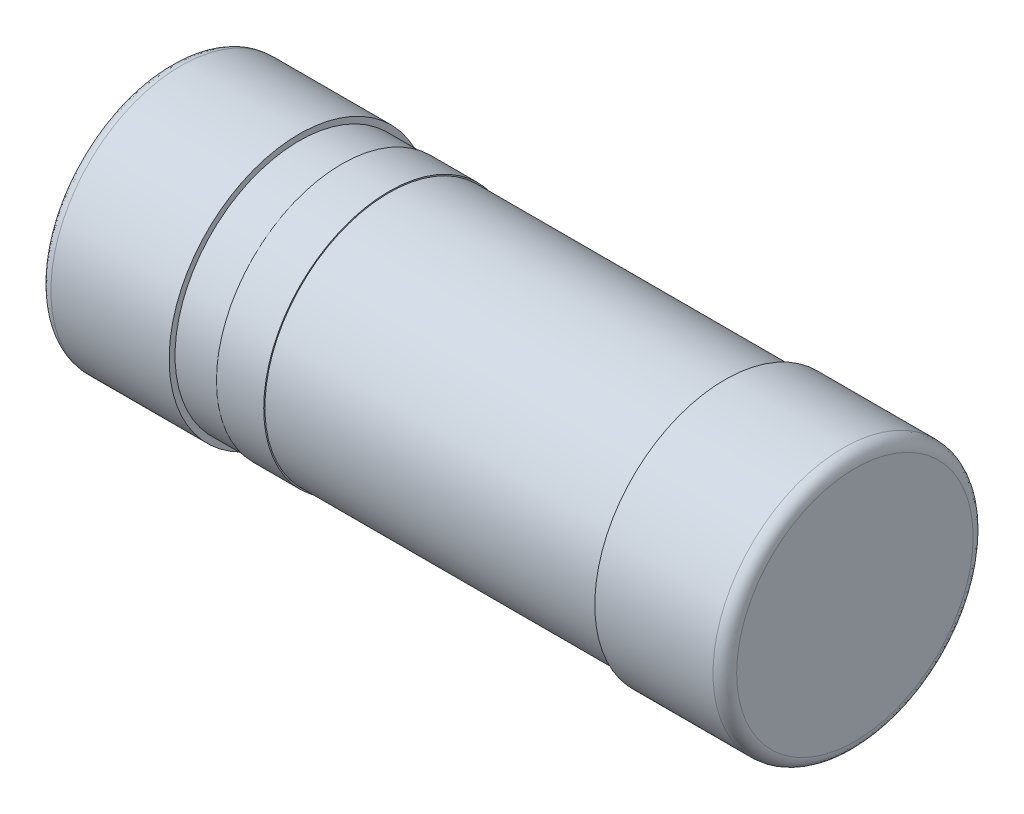
ISO-10303-21;
HEADER;
FILE_DESCRIPTION(('STEP AP214'),'2;1');
FILE_NAME('part.step','',(''),(''),'','','');
FILE_SCHEMA(('AUTOMOTIVE_DESIGN { 1 0 10303 214 1 1 1 1 }'));
ENDSEC;
DATA;
#1=APPLICATION_CONTEXT('core data for automotive mechanical design processes');
#2=APPLICATION_PROTOCOL_DEFINITION('international standard','automotive_design',2000,#1);
#3=PRODUCT_CONTEXT('',#1,'mechanical');
#4=PRODUCT('Part','Part','',(#3));
#5=PRODUCT_RELATED_PRODUCT_CATEGORY('part','',(#4));
#6=PRODUCT_DEFINITION_FORMATION('','',#4);
#7=PRODUCT_DEFINITION_CONTEXT('part definition',#1,'design');
#8=PRODUCT_DEFINITION('design','',#6,#7);
#9=PRODUCT_DEFINITION_SHAPE('','',#8);
#10=(LENGTH_UNIT() NAMED_UNIT(*) SI_UNIT(.MILLI.,.METRE.));
#11=(NAMED_UNIT(*) PLANE_ANGLE_UNIT() SI_UNIT($,.RADIAN.));
#12=(NAMED_UNIT(*) SI_UNIT($,.STERADIAN.) SOLID_ANGLE_UNIT());
#13=UNCERTAINTY_MEASURE_WITH_UNIT(LENGTH_MEASURE(1.E-05),#10,'distance_accuracy_value','');
#14=(GEOMETRIC_REPRESENTATION_CONTEXT(3) GLOBAL_UNCERTAINTY_ASSIGNED_CONTEXT((#13)) GLOBAL_UNIT_ASSIGNED_CONTEXT((#10,
#11,#12)) REPRESENTATION_CONTEXT('',''));
#15=CARTESIAN_POINT('',(0.,0.,0.));
#16=DIRECTION('',(0.,0.,1.));
#17=DIRECTION('',(1.,0.,0.));
#18=AXIS2_PLACEMENT_3D('',#15,#16,#17);
#19=CARTESIAN_POINT('',(-2.9,0.,1.1));
#20=DIRECTION('',(-1.,0.,0.));
#21=DIRECTION('',(0.,0.,1.));
#22=AXIS2_PLACEMENT_3D('',#19,#20,#21);
#23=PLANE('',#22);
#24=CARTESIAN_POINT('',(-2.9,0.,1.1));
#25=DIRECTION('',(-1.,0.,0.));
#26=DIRECTION('',(0.,0.,-1.));
#27=AXIS2_PLACEMENT_3D('',#24,#25,#26);
#28=CIRCLE('',#27,1.);
#29=CARTESIAN_POINT('',(-2.9,0.,0.09999999999999));
#30=VERTEX_POINT('',#29);
#31=EDGE_CURVE('E11',#30,#30,#28,.T.);
#32=ORIENTED_EDGE('',*,*,#31,.T.);
#33=EDGE_LOOP('',(#32));
#34=FACE_BOUND('',#33,.T.);
#35=ADVANCED_FACE('F17',(#34),#23,.T.);
#36=CARTESIAN_POINT('',(2.9,0.,1.1));
#37=DIRECTION('',(-1.,0.,0.));
#38=DIRECTION('',(0.,0.,1.));
#39=AXIS2_PLACEMENT_3D('',#36,#37,#38);
#40=PLANE('',#39);
#41=CARTESIAN_POINT('',(2.9,0.,1.1));
#42=DIRECTION('',(-1.,0.,0.));
#43=DIRECTION('',(0.,0.,-1.));
#44=AXIS2_PLACEMENT_3D('',#41,#42,#43);
#45=CIRCLE('',#44,1.);
#46=CARTESIAN_POINT('',(2.9,0.,0.1));
#47=VERTEX_POINT('',#46);
#48=EDGE_CURVE('E116',#47,#47,#45,.T.);
#49=ORIENTED_EDGE('',*,*,#48,.F.);
#50=EDGE_LOOP('',(#49));
#51=FACE_BOUND('',#50,.T.);
#52=ADVANCED_FACE('F157',(#51),#40,.F.);
#53=CARTESIAN_POINT('',(-2.9,0.,0.09999999999999));
#54=CARTESIAN_POINT('',(-2.89999999999999,0.,0.0414213562373039));
#55=CARTESIAN_POINT('',(-2.85857864376268,0.,0.));
#56=CARTESIAN_POINT('',(-2.8,0.,0.));
#57=(BOUNDED_CURVE() B_SPLINE_CURVE(3,(#53,#54,#55,#56),.UNSPECIFIED.,.F.,
.F.) B_SPLINE_CURVE_WITH_KNOTS((4,4),(0.,1.),
.UNSPECIFIED.) CURVE() GEOMETRIC_REPRESENTATION_ITEM() RATIONAL_B_SPLINE_CURVE((1.,
0.804737854124388,0.804737854124388,1.)) REPRESENTATION_ITEM(''));
#58=CARTESIAN_POINT('',(-7.1,0.,1.1));
#59=DIRECTION('',(1.,0.,0.));
#60=AXIS1_PLACEMENT('',#58,#59);
#61=SURFACE_OF_REVOLUTION('',#57,#60);
#62=CARTESIAN_POINT('',(-2.8,0.,0.1));
#63=DIRECTION('',(0.,-1.,0.));
#64=DIRECTION('',(1.,0.,0.));
#65=AXIS2_PLACEMENT_3D('',#62,#63,#64);
#66=CIRCLE('',#65,0.1);
#67=CARTESIAN_POINT('',(-2.8,0.,0.));
#68=VERTEX_POINT('',#67);
#69=EDGE_CURVE('E30',#30,#68,#66,.T.);
#70=ORIENTED_EDGE('',*,*,#69,.T.);
#71=CARTESIAN_POINT('',(-2.8,0.,1.1));
#72=DIRECTION('',(-1.,0.,0.));
#73=DIRECTION('',(0.,0.,-1.));
#74=AXIS2_PLACEMENT_3D('',#71,#72,#73);
#75=CIRCLE('',#74,1.1);
#76=EDGE_CURVE('E114',#68,#68,#75,.T.);
#77=ORIENTED_EDGE('',*,*,#76,.T.);
#78=ORIENTED_EDGE('',*,*,#69,.F.);
#79=ORIENTED_EDGE('',*,*,#31,.F.);
#80=EDGE_LOOP('',(#70,#77,#78,#79));
#81=FACE_BOUND('',#80,.T.);
#82=ADVANCED_FACE('F113',(#81),#61,.T.);
#83=CARTESIAN_POINT('',(2.8,0.,0.));
#84=CARTESIAN_POINT('',(2.85857864376269,0.,0.));
#85=CARTESIAN_POINT('',(2.9,0.,0.0414213562373093));
#86=CARTESIAN_POINT('',(2.9,0.,0.1));
#87=(BOUNDED_CURVE() B_SPLINE_CURVE(3,(#83,#84,#85,#86),.UNSPECIFIED.,.F.,
.F.) B_SPLINE_CURVE_WITH_KNOTS((4,4),(0.,1.),
.UNSPECIFIED.) CURVE() GEOMETRIC_REPRESENTATION_ITEM() RATIONAL_B_SPLINE_CURVE((1.,
0.804737854124364,0.804737854124364,1.)) REPRESENTATION_ITEM(''));
#88=CARTESIAN_POINT('',(-7.1,0.,1.1));
#89=DIRECTION('',(1.,0.,0.));
#90=AXIS1_PLACEMENT('',#88,#89);
#91=SURFACE_OF_REVOLUTION('',#87,#90);
#92=CARTESIAN_POINT('',(2.8,0.,0.1));
#93=DIRECTION('',(0.,-1.,0.));
#94=DIRECTION('',(1.,0.,0.));
#95=AXIS2_PLACEMENT_3D('',#92,#93,#94);
#96=CIRCLE('',#95,0.1);
#97=CARTESIAN_POINT('',(2.8,0.,0.));
#98=VERTEX_POINT('',#97);
#99=EDGE_CURVE('E105',#98,#47,#96,.T.);
#100=ORIENTED_EDGE('',*,*,#99,.T.);
#101=ORIENTED_EDGE('',*,*,#48,.T.);
#102=ORIENTED_EDGE('',*,*,#99,.F.);
#103=CARTESIAN_POINT('',(2.8,0.,1.1));
#104=DIRECTION('',(-1.,0.,0.));
#105=DIRECTION('',(0.,0.,-1.));
#106=AXIS2_PLACEMENT_3D('',#103,#104,#105);
#107=CIRCLE('',#106,1.1);
#108=EDGE_CURVE('E133',#98,#98,#107,.T.);
#109=ORIENTED_EDGE('',*,*,#108,.F.);
#110=EDGE_LOOP('',(#100,#101,#102,#109));
#111=FACE_BOUND('',#110,.T.);
#112=ADVANCED_FACE('F19',(#111),#91,.T.);
#113=CARTESIAN_POINT('',(-2.8,0.,1.1));
#114=DIRECTION('',(1.,0.,0.));
#115=DIRECTION('',(0.,0.,-1.));
#116=AXIS2_PLACEMENT_3D('',#113,#114,#115);
#117=CYLINDRICAL_SURFACE('',#116,1.1);
#118=DIRECTION('',(1.,0.,0.));
#119=VECTOR('',#118,1.);
#120=CARTESIAN_POINT('',(-2.8,0.,0.));
#121=LINE('',#120,#119);
#122=CARTESIAN_POINT('',(-1.8,0.,0.));
#123=VERTEX_POINT('',#122);
#124=EDGE_CURVE('E99',#68,#123,#121,.T.);
#125=ORIENTED_EDGE('',*,*,#124,.T.);
#126=CARTESIAN_POINT('',(-1.8,0.,1.1));
#127=DIRECTION('',(-1.,0.,0.));
#128=DIRECTION('',(0.,0.,-1.));
#129=AXIS2_PLACEMENT_3D('',#126,#127,#128);
#130=CIRCLE('',#129,1.1);
#131=EDGE_CURVE('E134',#123,#123,#130,.T.);
#132=ORIENTED_EDGE('',*,*,#131,.T.);
#133=ORIENTED_EDGE('',*,*,#124,.F.);
#134=ORIENTED_EDGE('',*,*,#76,.F.);
#135=EDGE_LOOP('',(#125,#132,#133,#134));
#136=FACE_BOUND('',#135,.T.);
#137=ADVANCED_FACE('F184',(#136),#117,.T.);
#138=CARTESIAN_POINT('',(1.8,0.,1.1));
#139=DIRECTION('',(1.,0.,0.));
#140=DIRECTION('',(0.,0.,-1.));
#141=AXIS2_PLACEMENT_3D('',#138,#139,#140);
#142=CYLINDRICAL_SURFACE('',#141,1.1);
#143=DIRECTION('',(1.,0.,0.));
#144=VECTOR('',#143,1.);
#145=CARTESIAN_POINT('',(1.8,0.,0.));
#146=LINE('',#145,#144);
#147=CARTESIAN_POINT('',(1.8,0.,0.));
#148=VERTEX_POINT('',#147);
#149=EDGE_CURVE('E90',#148,#98,#146,.T.);
#150=ORIENTED_EDGE('',*,*,#149,.T.);
#151=ORIENTED_EDGE('',*,*,#108,.T.);
#152=ORIENTED_EDGE('',*,*,#149,.F.);
#153=CARTESIAN_POINT('',(1.8,0.,1.1));
#154=DIRECTION('',(-1.,0.,0.));
#155=DIRECTION('',(0.,0.,-1.));
#156=AXIS2_PLACEMENT_3D('',#153,#154,#155);
#157=CIRCLE('',#156,1.1);
#158=EDGE_CURVE('E137',#148,#148,#157,.T.);
#159=ORIENTED_EDGE('',*,*,#158,.F.);
#160=EDGE_LOOP('',(#150,#151,#152,#159));
#161=FACE_BOUND('',#160,.T.);
#162=ADVANCED_FACE('F175',(#161),#142,.T.);
#163=CARTESIAN_POINT('',(-1.8,0.,1.1));
#164=DIRECTION('',(-1.,0.,0.));
#165=DIRECTION('',(0.,0.,1.));
#166=AXIS2_PLACEMENT_3D('',#163,#164,#165);
#167=PLANE('',#166);
#168=CARTESIAN_POINT('',(-1.8,0.,1.1));
#169=DIRECTION('',(-1.,0.,0.));
#170=DIRECTION('',(0.,0.,-1.));
#171=AXIS2_PLACEMENT_3D('',#168,#169,#170);
#172=CIRCLE('',#171,1.05);
#173=CARTESIAN_POINT('',(-1.8,0.,0.05));
#174=VERTEX_POINT('',#173);
#175=EDGE_CURVE('E125',#174,#174,#172,.T.);
#176=ORIENTED_EDGE('',*,*,#175,.T.);
#177=EDGE_LOOP('',(#176));
#178=FACE_BOUND('',#177,.T.);
#179=ORIENTED_EDGE('',*,*,#131,.F.);
#180=EDGE_LOOP('',(#179));
#181=FACE_BOUND('',#180,.T.);
#182=ADVANCED_FACE('F172',(#178,#181),#167,.F.);
#183=CARTESIAN_POINT('',(1.8,0.,1.1));
#184=DIRECTION('',(-1.,0.,0.));
#185=DIRECTION('',(0.,0.,1.));
#186=AXIS2_PLACEMENT_3D('',#183,#184,#185);
#187=PLANE('',#186);
#188=CARTESIAN_POINT('',(1.8,0.,1.1));
#189=DIRECTION('',(-1.,0.,0.));
#190=DIRECTION('',(0.,0.,-1.));
#191=AXIS2_PLACEMENT_3D('',#188,#189,#190);
#192=CIRCLE('',#191,1.05);
#193=CARTESIAN_POINT('',(1.8,0.,0.05));
#194=VERTEX_POINT('',#193);
#195=EDGE_CURVE('E129',#194,#194,#192,.T.);
#196=ORIENTED_EDGE('',*,*,#195,.F.);
#197=EDGE_LOOP('',(#196));
#198=FACE_BOUND('',#197,.T.);
#199=ORIENTED_EDGE('',*,*,#158,.T.);
#200=EDGE_LOOP('',(#199));
#201=FACE_BOUND('',#200,.T.);
#202=ADVANCED_FACE('F171',(#198,#201),#187,.T.);
#203=CARTESIAN_POINT('',(2.35,0.,1.1));
#204=DIRECTION('',(-1.,0.,0.));
#205=DIRECTION('',(0.,0.,-1.));
#206=AXIS2_PLACEMENT_3D('',#203,#204,#205);
#207=CYLINDRICAL_SURFACE('',#206,1.05);
#208=CARTESIAN_POINT('',(-1.44,0.,1.1));
#209=DIRECTION('',(-1.,0.,0.));
#210=DIRECTION('',(0.,0.,-1.));
#211=AXIS2_PLACEMENT_3D('',#208,#209,#210);
#212=CIRCLE('',#211,1.05);
#213=CARTESIAN_POINT('',(-1.44,0.,0.05));
#214=VERTEX_POINT('',#213);
#215=EDGE_CURVE('E127',#214,#214,#212,.T.);
#216=ORIENTED_EDGE('',*,*,#215,.T.);
#217=DIRECTION('',(-1.,0.,0.));
#218=VECTOR('',#217,1.);
#219=CARTESIAN_POINT('',(2.35,0.,0.05));
#220=LINE('',#219,#218);
#221=EDGE_CURVE('E58',#214,#174,#220,.T.);
#222=ORIENTED_EDGE('',*,*,#221,.T.);
#223=ORIENTED_EDGE('',*,*,#175,.F.);
#224=ORIENTED_EDGE('',*,*,#221,.F.);
#225=EDGE_LOOP('',(#216,#222,#223,#224));
#226=FACE_BOUND('',#225,.T.);
#227=ADVANCED_FACE('F168',(#226),#207,.T.);
#228=CARTESIAN_POINT('',(2.35,0.,1.1));
#229=DIRECTION('',(-1.,0.,0.));
#230=DIRECTION('',(0.,0.,-1.));
#231=AXIS2_PLACEMENT_3D('',#228,#229,#230);
#232=CYLINDRICAL_SURFACE('',#231,1.05);
#233=ORIENTED_EDGE('',*,*,#195,.T.);
#234=DIRECTION('',(-1.,0.,0.));
#235=VECTOR('',#234,1.);
#236=CARTESIAN_POINT('',(2.35,0.,0.05));
#237=LINE('',#236,#235);
#238=CARTESIAN_POINT('',(-1.04,0.,0.05));
#239=VERTEX_POINT('',#238);
#240=EDGE_CURVE('E73',#194,#239,#237,.T.);
#241=ORIENTED_EDGE('',*,*,#240,.T.);
#242=CARTESIAN_POINT('',(-1.04,0.,1.1));
#243=DIRECTION('',(-1.,0.,0.));
#244=DIRECTION('',(0.,0.,-1.));
#245=AXIS2_PLACEMENT_3D('',#242,#243,#244);
#246=CIRCLE('',#245,1.05);
#247=EDGE_CURVE('E130',#239,#239,#246,.T.);
#248=ORIENTED_EDGE('',*,*,#247,.F.);
#249=ORIENTED_EDGE('',*,*,#240,.F.);
#250=EDGE_LOOP('',(#233,#241,#248,#249));
#251=FACE_BOUND('',#250,.T.);
#252=ADVANCED_FACE('F166',(#251),#232,.T.);
#253=CARTESIAN_POINT('',(-1.44,0.,1.1));
#254=DIRECTION('',(-1.,0.,0.));
#255=DIRECTION('',(0.,0.,1.));
#256=AXIS2_PLACEMENT_3D('',#253,#254,#255);
#257=PLANE('',#256);
#258=ORIENTED_EDGE('',*,*,#215,.F.);
#259=EDGE_LOOP('',(#258));
#260=FACE_BOUND('',#259,.T.);
#261=CARTESIAN_POINT('',(-1.44,0.,1.1));
#262=DIRECTION('',(-1.,0.,0.));
#263=DIRECTION('',(0.,0.,-1.));
#264=AXIS2_PLACEMENT_3D('',#261,#262,#263);
#265=CIRCLE('',#264,1.06);
#266=CARTESIAN_POINT('',(-1.44,0.,0.04));
#267=VERTEX_POINT('',#266);
#268=EDGE_CURVE('E144',#267,#267,#265,.T.);
#269=ORIENTED_EDGE('',*,*,#268,.T.);
#270=EDGE_LOOP('',(#269));
#271=FACE_BOUND('',#270,.T.);
#272=ADVANCED_FACE('F163',(#260,#271),#257,.T.);
#273=CARTESIAN_POINT('',(-1.04,0.,1.1));
#274=DIRECTION('',(-1.,0.,0.));
#275=DIRECTION('',(0.,0.,1.));
#276=AXIS2_PLACEMENT_3D('',#273,#274,#275);
#277=PLANE('',#276);
#278=ORIENTED_EDGE('',*,*,#247,.T.);
#279=EDGE_LOOP('',(#278));
#280=FACE_BOUND('',#279,.T.);
#281=CARTESIAN_POINT('',(-1.04,0.,1.1));
#282=DIRECTION('',(-1.,0.,0.));
#283=DIRECTION('',(0.,0.,-1.));
#284=AXIS2_PLACEMENT_3D('',#281,#282,#283);
#285=CIRCLE('',#284,1.06);
#286=CARTESIAN_POINT('',(-1.04,0.,0.04));
#287=VERTEX_POINT('',#286);
#288=EDGE_CURVE('E148',#287,#287,#285,.T.);
#289=ORIENTED_EDGE('',*,*,#288,.F.);
#290=EDGE_LOOP('',(#289));
#291=FACE_BOUND('',#290,.T.);
#292=ADVANCED_FACE('F161',(#280,#291),#277,.F.);
#293=CARTESIAN_POINT('',(-1.04,0.,1.1));
#294=DIRECTION('',(-1.,0.,0.));
#295=DIRECTION('',(0.,0.,-1.));
#296=AXIS2_PLACEMENT_3D('',#293,#294,#295);
#297=CYLINDRICAL_SURFACE('',#296,1.06);
#298=ORIENTED_EDGE('',*,*,#288,.T.);
#299=DIRECTION('',(-1.,0.,0.));
#300=VECTOR('',#299,1.);
#301=CARTESIAN_POINT('',(-1.04,0.,0.04));
#302=LINE('',#301,#300);
#303=EDGE_CURVE('E145',#287,#267,#302,.T.);
#304=ORIENTED_EDGE('',*,*,#303,.T.);
#305=ORIENTED_EDGE('',*,*,#268,.F.);
#306=ORIENTED_EDGE('',*,*,#303,.F.);
#307=EDGE_LOOP('',(#298,#304,#305,#306));
#308=FACE_BOUND('',#307,.T.);
#309=ADVANCED_FACE('F158',(#308),#297,.T.);
#310=CLOSED_SHELL('',(#35,#52,#82,#112,#137,#162,#182,#202,#227,#252,#272,#292,#309));
#311=MANIFOLD_SOLID_BREP('B1',#310);
#312=ADVANCED_BREP_SHAPE_REPRESENTATION('',(#18,#311),#14);
#313=SHAPE_DEFINITION_REPRESENTATION(#9,#312);
ENDSEC;
END-ISO-10303-21;
